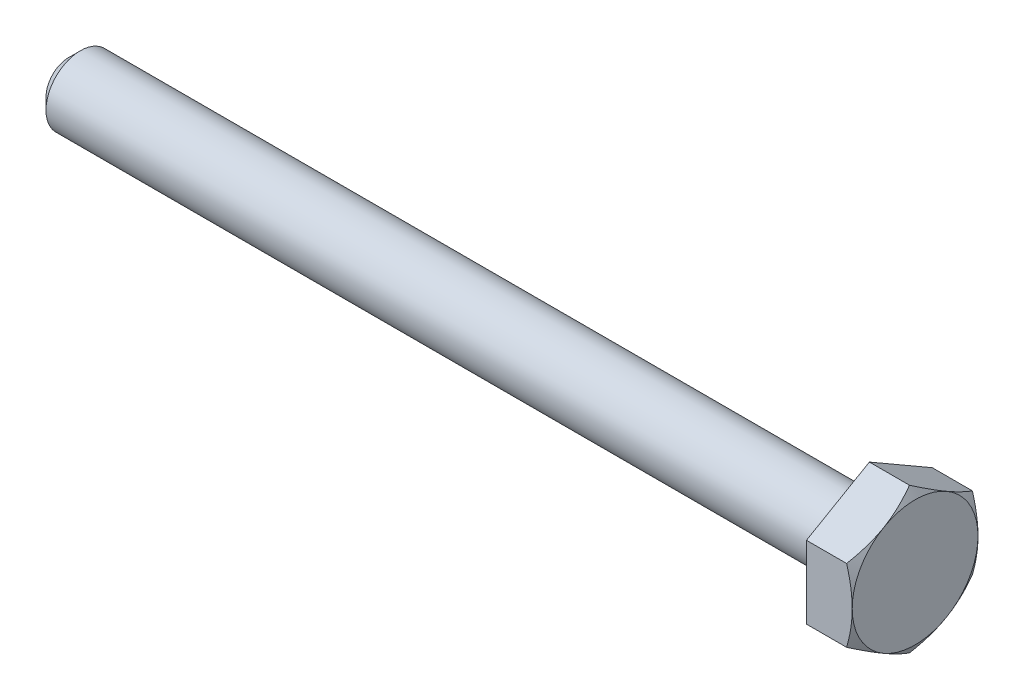
ISO-10303-21;
HEADER;
FILE_DESCRIPTION(('STEP AP214'),'2;1');
FILE_NAME('part.step','',(''),(''),'','','');
FILE_SCHEMA(('AUTOMOTIVE_DESIGN { 1 0 10303 214 1 1 1 1 }'));
ENDSEC;
DATA;
#1=APPLICATION_CONTEXT('core data for automotive mechanical design processes');
#2=APPLICATION_PROTOCOL_DEFINITION('international standard','automotive_design',2000,#1);
#3=PRODUCT_CONTEXT('',#1,'mechanical');
#4=PRODUCT('Part','Part','',(#3));
#5=PRODUCT_RELATED_PRODUCT_CATEGORY('part','',(#4));
#6=PRODUCT_DEFINITION_FORMATION('','',#4);
#7=PRODUCT_DEFINITION_CONTEXT('part definition',#1,'design');
#8=PRODUCT_DEFINITION('design','',#6,#7);
#9=PRODUCT_DEFINITION_SHAPE('','',#8);
#10=(LENGTH_UNIT() NAMED_UNIT(*) SI_UNIT(.MILLI.,.METRE.));
#11=(NAMED_UNIT(*) PLANE_ANGLE_UNIT() SI_UNIT($,.RADIAN.));
#12=(NAMED_UNIT(*) SI_UNIT($,.STERADIAN.) SOLID_ANGLE_UNIT());
#13=UNCERTAINTY_MEASURE_WITH_UNIT(LENGTH_MEASURE(1.E-05),#10,'distance_accuracy_value','');
#14=(GEOMETRIC_REPRESENTATION_CONTEXT(3) GLOBAL_UNCERTAINTY_ASSIGNED_CONTEXT((#13)) GLOBAL_UNIT_ASSIGNED_CONTEXT((#10,
#11,#12)) REPRESENTATION_CONTEXT('',''));
#15=CARTESIAN_POINT('',(0.,0.,0.));
#16=DIRECTION('',(0.,0.,1.));
#17=DIRECTION('',(1.,0.,0.));
#18=AXIS2_PLACEMENT_3D('',#15,#16,#17);
#19=CARTESIAN_POINT('',(-10.4013887740857,3.17542648054294,0.));
#20=DIRECTION('',(0.,0.866025403784439,0.5));
#21=DIRECTION('',(0.,-0.5,0.866025403784439));
#22=AXIS2_PLACEMENT_3D('',#19,#20,#21);
#23=PLANE('',#22);
#24=DIRECTION('',(1.,0.,0.));
#25=VECTOR('',#24,1.);
#26=CARTESIAN_POINT('',(-10.4013887740857,1.58771324027147,2.75));
#27=LINE('',#26,#25);
#28=CARTESIAN_POINT('',(-2.,1.58771324027147,2.75));
#29=VERTEX_POINT('',#28);
#30=CARTESIAN_POINT('',(-0.24562009306186,1.58771324027147,2.75));
#31=VERTEX_POINT('',#30);
#32=EDGE_CURVE('E251',#29,#31,#27,.T.);
#33=ORIENTED_EDGE('',*,*,#32,.T.);
#34=CARTESIAN_POINT('',(-0.245686763364758,1.58759777021763,2.7502));
#35=CARTESIAN_POINT('',(-0.205387662249261,1.65737010029698,2.62935077934009));
#36=CARTESIAN_POINT('',(-0.16873690259766,1.72774469983533,2.50745839737737));
#37=CARTESIAN_POINT('',(-0.104762182969799,1.86971254687002,2.26156287327211));
#38=CARTESIAN_POINT('',(-0.0774608556744957,1.94130831721582,2.13755536142615));
#39=CARTESIAN_POINT('',(-0.0349617452941152,2.08361254889598,1.89107720202406));
#40=CARTESIAN_POINT('',(-0.019481118622456,2.15429911309864,1.76864448141258));
#41=CARTESIAN_POINT('',(-0.00099939736993851,2.29600490065922,1.52320285763109));
#42=CARTESIAN_POINT('',(0.00201700053740233,2.36702360884403,1.40019484676709));
#43=CARTESIAN_POINT('',(-0.00425314542854439,2.49972966594896,1.17034121338921));
#44=CARTESIAN_POINT('',(-0.0120001542766999,2.56143686540072,1.06346120874598));
#45=CARTESIAN_POINT('',(-0.0365551810643523,2.68444923614046,0.850397532665251));
#46=CARTESIAN_POINT('',(-0.0533715896505678,2.74575398185007,0.744214598351111));
#47=CARTESIAN_POINT('',(-0.0954119223459535,2.86902004703206,0.530711510606817));
#48=CARTESIAN_POINT('',(-0.120814080687228,2.93096576264318,0.423418383857145));
#49=CARTESIAN_POINT('',(-0.178467225839978,3.05393320806133,0.210432520715949));
#50=CARTESIAN_POINT('',(-0.210704663298979,3.11495651365995,0.104737054973347));
#51=CARTESIAN_POINT('',(-0.245686763364757,3.17554195059677,-0.000200000000000022));
#52=B_SPLINE_CURVE_WITH_KNOTS('',3,(#34,#35,#36,#37,#38,#39,#40,#41,#42,#43,#44,#45,#46,#47,#48,
#49,#50,#51),.UNSPECIFIED.,.F.,.F.,(4,2,2,2,2,2,2,2,4),(0.,0.435912828725888,0.872873557116331,
1.29901931904671,1.72464171213573,2.09526089052937,2.46622354066374,2.84541551798557,
3.22386274754524),.UNSPECIFIED.);
#53=CARTESIAN_POINT('',(0.,2.38156986040721,1.375));
#54=VERTEX_POINT('',#53);
#55=EDGE_CURVE('E114',#31,#54,#52,.T.);
#56=ORIENTED_EDGE('',*,*,#55,.T.);
#57=CARTESIAN_POINT('',(-0.245620093061859,3.17542648054294,0.));
#58=VERTEX_POINT('',#57);
#59=EDGE_CURVE('E51',#54,#58,#52,.T.);
#60=ORIENTED_EDGE('',*,*,#59,.T.);
#61=DIRECTION('',(1.,0.,0.));
#62=VECTOR('',#61,1.);
#63=CARTESIAN_POINT('',(-10.4013887740857,3.17542648054294,0.));
#64=LINE('',#63,#62);
#65=CARTESIAN_POINT('',(-2.,3.17542648054294,0.));
#66=VERTEX_POINT('',#65);
#67=EDGE_CURVE('E232',#66,#58,#64,.T.);
#68=ORIENTED_EDGE('',*,*,#67,.F.);
#69=DIRECTION('',(0.,0.5,-0.866025403784439));
#70=VECTOR('',#69,1.);
#71=CARTESIAN_POINT('',(-2.,3.17542648054294,0.));
#72=LINE('',#71,#70);
#73=EDGE_CURVE('E242',#29,#66,#72,.T.);
#74=ORIENTED_EDGE('',*,*,#73,.F.);
#75=EDGE_LOOP('',(#33,#56,#60,#68,#74));
#76=FACE_BOUND('',#75,.T.);
#77=ADVANCED_FACE('F36',(#76),#23,.T.);
#78=CARTESIAN_POINT('',(-10.4013887740857,1.58771324027147,-2.75));
#79=DIRECTION('',(0.,0.866025403784439,-0.5));
#80=DIRECTION('',(0.,0.5,0.866025403784439));
#81=AXIS2_PLACEMENT_3D('',#78,#79,#80);
#82=PLANE('',#81);
#83=ORIENTED_EDGE('',*,*,#67,.T.);
#84=CARTESIAN_POINT('',(-0.245686763364757,3.17554195059677,0.000199999999999889));
#85=CARTESIAN_POINT('',(-0.20538766224926,3.10576962051742,-0.120649220659906));
#86=CARTESIAN_POINT('',(-0.168736902597659,3.03539502097908,-0.242541602622634));
#87=CARTESIAN_POINT('',(-0.104762182969798,2.89342717394438,-0.488437126727892));
#88=CARTESIAN_POINT('',(-0.0774608556744949,2.82183140359858,-0.612444638573854));
#89=CARTESIAN_POINT('',(-0.0349617452941147,2.67952717191842,-0.858922797975942));
#90=CARTESIAN_POINT('',(-0.0194811186224558,2.60884060771577,-0.981355518587416));
#91=CARTESIAN_POINT('',(-0.000999397369938532,2.46713482015518,-1.22679714236891));
#92=CARTESIAN_POINT('',(0.00201700053740236,2.39611611197037,-1.34980515323291));
#93=CARTESIAN_POINT('',(-0.00425314542854449,2.26341005486544,-1.57965878661079));
#94=CARTESIAN_POINT('',(-0.0120001542767001,2.20170285541368,-1.68653879125402));
#95=CARTESIAN_POINT('',(-0.0365551810643526,2.07869048467394,-1.89960246733475));
#96=CARTESIAN_POINT('',(-0.0533715896505681,2.01738573896433,-2.00578540164889));
#97=CARTESIAN_POINT('',(-0.095411922345954,1.89411967378235,-2.21928848939318));
#98=CARTESIAN_POINT('',(-0.120814080687228,1.83217395817123,-2.32658161614285));
#99=CARTESIAN_POINT('',(-0.178467225839979,1.70920651275307,-2.53956747928405));
#100=CARTESIAN_POINT('',(-0.210704663298979,1.64818320715446,-2.64526294502665));
#101=CARTESIAN_POINT('',(-0.245686763364757,1.58759777021763,-2.7502));
#102=B_SPLINE_CURVE_WITH_KNOTS('',3,(#84,#85,#86,#87,#88,#89,#90,#91,#92,#93,#94,#95,#96,#97,
#98,#99,#100,#101),.UNSPECIFIED.,.F.,.F.,(4,2,2,2,2,2,2,2,4),(0.,0.435912828725887,
0.87287355711633,1.29901931904671,1.72464171213573,2.09526089052937,2.46622354066374,
2.84541551798557,3.22386274754524),.UNSPECIFIED.);
#103=CARTESIAN_POINT('',(0.,2.38156986040721,-1.375));
#104=VERTEX_POINT('',#103);
#105=EDGE_CURVE('E185',#58,#104,#102,.T.);
#106=ORIENTED_EDGE('',*,*,#105,.T.);
#107=CARTESIAN_POINT('',(-0.245620093061859,1.58771324027147,-2.75));
#108=VERTEX_POINT('',#107);
#109=EDGE_CURVE('E59',#104,#108,#102,.T.);
#110=ORIENTED_EDGE('',*,*,#109,.T.);
#111=DIRECTION('',(1.,0.,0.));
#112=VECTOR('',#111,1.);
#113=CARTESIAN_POINT('',(-10.4013887740857,1.58771324027147,-2.75));
#114=LINE('',#113,#112);
#115=CARTESIAN_POINT('',(-2.,1.58771324027147,-2.75));
#116=VERTEX_POINT('',#115);
#117=EDGE_CURVE('E235',#116,#108,#114,.T.);
#118=ORIENTED_EDGE('',*,*,#117,.F.);
#119=DIRECTION('',(0.,-0.5,-0.866025403784439));
#120=VECTOR('',#119,1.);
#121=CARTESIAN_POINT('',(-2.,1.58771324027147,-2.75));
#122=LINE('',#121,#120);
#123=EDGE_CURVE('E233',#66,#116,#122,.T.);
#124=ORIENTED_EDGE('',*,*,#123,.F.);
#125=EDGE_LOOP('',(#83,#106,#110,#118,#124));
#126=FACE_BOUND('',#125,.T.);
#127=ADVANCED_FACE('F159',(#126),#82,.T.);
#128=CARTESIAN_POINT('',(-10.4013887740857,-1.58771324027147,-2.75));
#129=DIRECTION('',(0.,0.,-1.));
#130=DIRECTION('',(-1.,0.,0.));
#131=AXIS2_PLACEMENT_3D('',#128,#129,#130);
#132=PLANE('',#131);
#133=ORIENTED_EDGE('',*,*,#117,.T.);
#134=CARTESIAN_POINT('',(-1.59255708107006,4.77282494445559,-2.75));
#135=CARTESIAN_POINT('',(-1.53541655163729,4.65858396642317,-2.75));
#136=CARTESIAN_POINT('',(-1.47867048568092,4.54414359420139,-2.75));
#137=CARTESIAN_POINT('',(-1.36615985657659,4.31477714376181,-2.75));
#138=CARTESIAN_POINT('',(-1.31039532513564,4.19985105000168,-2.75));
#139=CARTESIAN_POINT('',(-1.19993280976673,3.96920131985217,-2.75));
#140=CARTESIAN_POINT('',(-1.14523720280532,3.85347654266311,-2.75));
#141=CARTESIAN_POINT('',(-1.03729153093637,3.62135136406463,-2.75));
#142=CARTESIAN_POINT('',(-0.984041487786225,3.50495095251809,-2.75));
#143=CARTESIAN_POINT('',(-0.87696786101102,3.26609541459747,-2.75));
#144=CARTESIAN_POINT('',(-0.823226205898884,3.14360343893143,-2.75));
#145=CARTESIAN_POINT('',(-0.718190973298418,2.89757544696494,-2.75));
#146=CARTESIAN_POINT('',(-0.666897310035495,2.77403946742389,-2.75));
#147=CARTESIAN_POINT('',(-0.567454092383856,2.52581175013779,-2.75));
#148=CARTESIAN_POINT('',(-0.519302129110342,2.40112098362696,-2.75));
#149=CARTESIAN_POINT('',(-0.426955755718839,2.15023551994533,-2.75));
#150=CARTESIAN_POINT('',(-0.382762451896562,2.02404041346349,-2.75));
#151=CARTESIAN_POINT('',(-0.289691856371039,1.74015544179621,-2.75));
#152=CARTESIAN_POINT('',(-0.242146974254297,1.58202059862527,-2.75));
#153=CARTESIAN_POINT('',(-0.157534227235877,1.26300749755252,-2.75));
#154=CARTESIAN_POINT('',(-0.12046019828901,1.10213091307466,-2.75));
#155=CARTESIAN_POINT('',(-0.0604110115298261,0.780476716937827,-2.75));
#156=CARTESIAN_POINT('',(-0.0372099993686549,0.619742624513789,-2.75));
#157=CARTESIAN_POINT('',(-0.00657806439621203,0.296787198188305,-2.75));
#158=CARTESIAN_POINT('',(0.000859562545900966,0.134566526019167,-2.75));
#159=CARTESIAN_POINT('',(-0.00102516229449548,-0.190746169681579,-2.75));
#160=CARTESIAN_POINT('',(-0.0104481791130051,-0.353837591738448,-2.75));
#161=CARTESIAN_POINT('',(-0.0449884511543012,-0.678358807465691,-2.75));
#162=CARTESIAN_POINT('',(-0.0701130468062283,-0.839787788051861,-2.75));
#163=CARTESIAN_POINT('',(-0.13381670209592,-1.16274920271509,-2.75));
#164=CARTESIAN_POINT('',(-0.172617928406297,-1.32423644205701,-2.75));
#165=CARTESIAN_POINT('',(-0.260421719139841,-1.6444473471029,-2.75));
#166=CARTESIAN_POINT('',(-0.309430017449597,-1.80316940490725,-2.75));
#167=CARTESIAN_POINT('',(-0.403764900415742,-2.084616918998,-2.75));
#168=CARTESIAN_POINT('',(-0.447663702915815,-2.20782965089682,-2.75));
#169=CARTESIAN_POINT('',(-0.539116838244357,-2.4528464667101,-2.75));
#170=CARTESIAN_POINT('',(-0.586670165192798,-2.57465092769694,-2.75));
#171=CARTESIAN_POINT('',(-0.684690627766121,-2.81717169217554,-2.75));
#172=CARTESIAN_POINT('',(-0.735159736271196,-2.93788719346298,-2.75));
#173=CARTESIAN_POINT('',(-0.838385578657603,-3.17833707831196,-2.75));
#174=CARTESIAN_POINT('',(-0.891142383449641,-3.29807143132432,-2.75));
#175=CARTESIAN_POINT('',(-0.996217807874877,-3.53167504621099,-2.75));
#176=CARTESIAN_POINT('',(-1.04846081459888,-3.64557842561137,-2.75));
#177=CARTESIAN_POINT('',(-1.15431494359639,-3.87274439019058,-2.75));
#178=CARTESIAN_POINT('',(-1.20792604464688,-3.98600698527652,-2.75));
#179=CARTESIAN_POINT('',(-1.31617682738221,-4.21179177446542,-2.75));
#180=CARTESIAN_POINT('',(-1.37081451881073,-4.324314924714,-2.75));
#181=CARTESIAN_POINT('',(-1.48102755482586,-4.5488974967187,-2.75));
#182=CARTESIAN_POINT('',(-1.53660287322809,-4.66095693131619,-2.75));
#183=CARTESIAN_POINT('',(-1.59255708107006,-4.77282494445559,-2.75));
#184=B_SPLINE_CURVE_WITH_KNOTS('',3,(#134,#135,#136,#137,#138,#139,#140,#141,#142,#143,#144,
#145,#146,#147,#148,#149,#150,#151,#152,#153,#154,#155,#156,#157,#158,#159,#160,#161,#162,#163,
#164,#165,#166,#167,#168,#169,#170,#171,#172,#173,#174,#175,#176,#177,#178,#179,#180,#181,#182,
#183),.UNSPECIFIED.,.F.,.F.,(4,2,2,2,2,2,2,2,2,2,2,2,2,2,2,2,2,2,2,2,2,2,2,2,4),(0.,
0.383204805408721,0.76642196703896,1.1504117435579,1.5344072963671,1.93567413634181,
2.33692690608693,2.73786831099897,3.13892141657086,3.63403657129583,4.12885964820764,
4.6153905959693,5.10171458170089,5.59095181842032,6.08041794297961,6.57823225640618,
7.07632697808524,7.46866040779735,7.86088623483422,8.25338063115746,8.64588720216369,
9.02181505445846,9.3977370785904,9.77299319303788,10.1482388452848),.UNSPECIFIED.);
#185=CARTESIAN_POINT('',(0.,0.,-2.75));
#186=VERTEX_POINT('',#185);
#187=EDGE_CURVE('E186',#108,#186,#184,.T.);
#188=ORIENTED_EDGE('',*,*,#187,.T.);
#189=CARTESIAN_POINT('',(-0.245620093061859,-1.58771324027147,-2.75));
#190=VERTEX_POINT('',#189);
#191=EDGE_CURVE('E175',#186,#190,#184,.T.);
#192=ORIENTED_EDGE('',*,*,#191,.T.);
#193=DIRECTION('',(1.,0.,0.));
#194=VECTOR('',#193,1.);
#195=CARTESIAN_POINT('',(-10.4013887740857,-1.58771324027147,-2.75));
#196=LINE('',#195,#194);
#197=CARTESIAN_POINT('',(-2.,-1.58771324027147,-2.75));
#198=VERTEX_POINT('',#197);
#199=EDGE_CURVE('E239',#198,#190,#196,.T.);
#200=ORIENTED_EDGE('',*,*,#199,.F.);
#201=DIRECTION('',(0.,-1.,0.));
#202=VECTOR('',#201,1.);
#203=CARTESIAN_POINT('',(-2.,-1.58771324027147,-2.75));
#204=LINE('',#203,#202);
#205=EDGE_CURVE('E392',#116,#198,#204,.T.);
#206=ORIENTED_EDGE('',*,*,#205,.F.);
#207=EDGE_LOOP('',(#133,#188,#192,#200,#206));
#208=FACE_BOUND('',#207,.T.);
#209=ADVANCED_FACE('F333',(#208),#132,.T.);
#210=CARTESIAN_POINT('',(-10.4013887740857,-3.17542648054294,0.));
#211=DIRECTION('',(0.,-0.866025403784438,-0.5));
#212=DIRECTION('',(0.,0.5,-0.866025403784438));
#213=AXIS2_PLACEMENT_3D('',#210,#211,#212);
#214=PLANE('',#213);
#215=ORIENTED_EDGE('',*,*,#199,.T.);
#216=CARTESIAN_POINT('',(-0.245686763364757,-1.58759777021763,-2.7502));
#217=CARTESIAN_POINT('',(-0.20538766224926,-1.65737010029698,-2.62935077934009));
#218=CARTESIAN_POINT('',(-0.168736902597659,-1.72774469983533,-2.50745839737736));
#219=CARTESIAN_POINT('',(-0.104762182969798,-1.86971254687002,-2.2615628732721));
#220=CARTESIAN_POINT('',(-0.0774608556744949,-1.94130831721583,-2.13755536142614));
#221=CARTESIAN_POINT('',(-0.0349617452941147,-2.08361254889598,-1.89107720202405));
#222=CARTESIAN_POINT('',(-0.019481118622456,-2.15429911309864,-1.76864448141258));
#223=CARTESIAN_POINT('',(-0.000999397369938659,-2.29600490065922,-1.52320285763108));
#224=CARTESIAN_POINT('',(0.00201700053740237,-2.36702360884403,-1.40019484676709));
#225=CARTESIAN_POINT('',(-0.00425314542854441,-2.49972966594897,-1.17034121338921));
#226=CARTESIAN_POINT('',(-0.0120001542767001,-2.56143686540072,-1.06346120874598));
#227=CARTESIAN_POINT('',(-0.0365551810643525,-2.68444923614046,-0.85039753266525));
#228=CARTESIAN_POINT('',(-0.053371589650568,-2.74575398185007,-0.744214598351111));
#229=CARTESIAN_POINT('',(-0.0954119223459539,-2.86902004703206,-0.530711510606816));
#230=CARTESIAN_POINT('',(-0.120814080687228,-2.93096576264318,-0.423418383857145));
#231=CARTESIAN_POINT('',(-0.178467225839979,-3.05393320806133,-0.210432520715948));
#232=CARTESIAN_POINT('',(-0.21070466329898,-3.11495651365995,-0.104737054973347));
#233=CARTESIAN_POINT('',(-0.245686763364758,-3.17554195059678,0.000200000000000447));
#234=B_SPLINE_CURVE_WITH_KNOTS('',3,(#216,#217,#218,#219,#220,#221,#222,#223,#224,#225,#226,
#227,#228,#229,#230,#231,#232,#233),.UNSPECIFIED.,.F.,.F.,(4,2,2,2,2,2,2,2,4),(0.,
0.435912828725887,0.87287355711633,1.29901931904671,1.72464171213573,2.09526089052937,
2.46622354066374,2.84541551798557,3.22386274754524),.UNSPECIFIED.);
#235=CARTESIAN_POINT('',(0.,-2.3815698604072,-1.375));
#236=VERTEX_POINT('',#235);
#237=EDGE_CURVE('E399',#190,#236,#234,.T.);
#238=ORIENTED_EDGE('',*,*,#237,.T.);
#239=CARTESIAN_POINT('',(-0.245620093061859,-3.17542648054294,0.));
#240=VERTEX_POINT('',#239);
#241=EDGE_CURVE('E168',#236,#240,#234,.T.);
#242=ORIENTED_EDGE('',*,*,#241,.T.);
#243=DIRECTION('',(1.,0.,0.));
#244=VECTOR('',#243,1.);
#245=CARTESIAN_POINT('',(-10.4013887740857,-3.17542648054294,0.));
#246=LINE('',#245,#244);
#247=CARTESIAN_POINT('',(-2.,-3.17542648054294,0.));
#248=VERTEX_POINT('',#247);
#249=EDGE_CURVE('E247',#248,#240,#246,.T.);
#250=ORIENTED_EDGE('',*,*,#249,.F.);
#251=DIRECTION('',(0.,-0.5,0.866025403784438));
#252=VECTOR('',#251,1.);
#253=CARTESIAN_POINT('',(-2.,-3.17542648054294,0.));
#254=LINE('',#253,#252);
#255=EDGE_CURVE('E238',#198,#248,#254,.T.);
#256=ORIENTED_EDGE('',*,*,#255,.F.);
#257=EDGE_LOOP('',(#215,#238,#242,#250,#256));
#258=FACE_BOUND('',#257,.T.);
#259=ADVANCED_FACE('F325',(#258),#214,.T.);
#260=CARTESIAN_POINT('',(-10.4013887740857,-1.58771324027147,2.75));
#261=DIRECTION('',(0.,-0.866025403784439,0.5));
#262=DIRECTION('',(0.,-0.5,-0.866025403784439));
#263=AXIS2_PLACEMENT_3D('',#260,#261,#262);
#264=PLANE('',#263);
#265=ORIENTED_EDGE('',*,*,#249,.T.);
#266=CARTESIAN_POINT('',(-0.245686763364757,-3.17554195059678,-0.000199999999999798));
#267=CARTESIAN_POINT('',(-0.20538766224926,-3.10576962051742,0.120649220659906));
#268=CARTESIAN_POINT('',(-0.16873690259766,-3.03539502097908,0.242541602622634));
#269=CARTESIAN_POINT('',(-0.104762182969799,-2.89342717394438,0.488437126727892));
#270=CARTESIAN_POINT('',(-0.0774608556744955,-2.82183140359858,0.612444638573855));
#271=CARTESIAN_POINT('',(-0.0349617452941152,-2.67952717191842,0.858922797975943));
#272=CARTESIAN_POINT('',(-0.0194811186224562,-2.60884060771577,0.981355518587416));
#273=CARTESIAN_POINT('',(-0.00099939736993909,-2.46713482015518,1.22679714236891));
#274=CARTESIAN_POINT('',(0.00201700053740153,-2.39611611197037,1.34980515323291));
#275=CARTESIAN_POINT('',(-0.00425314542854547,-2.26341005486544,1.57965878661079));
#276=CARTESIAN_POINT('',(-0.0120001542767011,-2.20170285541368,1.68653879125402));
#277=CARTESIAN_POINT('',(-0.0365551810643533,-2.07869048467394,1.89960246733475));
#278=CARTESIAN_POINT('',(-0.0533715896505688,-2.01738573896433,2.00578540164889));
#279=CARTESIAN_POINT('',(-0.0954119223459547,-1.89411967378235,2.21928848939318));
#280=CARTESIAN_POINT('',(-0.120814080687229,-1.83217395817123,2.32658161614285));
#281=CARTESIAN_POINT('',(-0.17846722583998,-1.70920651275307,2.53956747928405));
#282=CARTESIAN_POINT('',(-0.210704663298981,-1.64818320715446,2.64526294502665));
#283=CARTESIAN_POINT('',(-0.245686763364759,-1.58759777021763,2.7502));
#284=B_SPLINE_CURVE_WITH_KNOTS('',3,(#266,#267,#268,#269,#270,#271,#272,#273,#274,#275,#276,
#277,#278,#279,#280,#281,#282,#283),.UNSPECIFIED.,.F.,.F.,(4,2,2,2,2,2,2,2,4),(0.,
0.435912828725887,0.87287355711633,1.29901931904671,1.72464171213573,2.09526089052937,
2.46622354066374,2.84541551798557,3.22386274754524),.UNSPECIFIED.);
#285=CARTESIAN_POINT('',(0.,-2.38156986040721,1.375));
#286=VERTEX_POINT('',#285);
#287=EDGE_CURVE('E139',#240,#286,#284,.T.);
#288=ORIENTED_EDGE('',*,*,#287,.T.);
#289=CARTESIAN_POINT('',(-0.245620093061859,-1.58771324027146,2.75));
#290=VERTEX_POINT('',#289);
#291=EDGE_CURVE('E126',#286,#290,#284,.T.);
#292=ORIENTED_EDGE('',*,*,#291,.T.);
#293=DIRECTION('',(1.,0.,0.));
#294=VECTOR('',#293,1.);
#295=CARTESIAN_POINT('',(-10.4013887740857,-1.58771324027147,2.75));
#296=LINE('',#295,#294);
#297=CARTESIAN_POINT('',(-2.,-1.58771324027147,2.75));
#298=VERTEX_POINT('',#297);
#299=EDGE_CURVE('E138',#298,#290,#296,.T.);
#300=ORIENTED_EDGE('',*,*,#299,.F.);
#301=DIRECTION('',(0.,0.5,0.866025403784439));
#302=VECTOR('',#301,1.);
#303=CARTESIAN_POINT('',(-2.,-1.58771324027147,2.75));
#304=LINE('',#303,#302);
#305=EDGE_CURVE('E192',#248,#298,#304,.T.);
#306=ORIENTED_EDGE('',*,*,#305,.F.);
#307=EDGE_LOOP('',(#265,#288,#292,#300,#306));
#308=FACE_BOUND('',#307,.T.);
#309=ADVANCED_FACE('F318',(#308),#264,.T.);
#310=CARTESIAN_POINT('',(-10.4013887740857,1.58771324027147,2.75));
#311=DIRECTION('',(0.,0.,1.));
#312=DIRECTION('',(0.,-1.,0.));
#313=AXIS2_PLACEMENT_3D('',#310,#311,#312);
#314=PLANE('',#313);
#315=ORIENTED_EDGE('',*,*,#299,.T.);
#316=CARTESIAN_POINT('',(-1.59255708107006,-4.77282494445559,2.75));
#317=CARTESIAN_POINT('',(-1.53541655163729,-4.65858396642317,2.75));
#318=CARTESIAN_POINT('',(-1.47867048568092,-4.54414359420139,2.75));
#319=CARTESIAN_POINT('',(-1.36615985657659,-4.31477714376181,2.75));
#320=CARTESIAN_POINT('',(-1.31039532513564,-4.19985105000168,2.75));
#321=CARTESIAN_POINT('',(-1.19993280976673,-3.96920131985217,2.75));
#322=CARTESIAN_POINT('',(-1.14523720280532,-3.85347654266311,2.75));
#323=CARTESIAN_POINT('',(-1.03729153093637,-3.62135136406463,2.75));
#324=CARTESIAN_POINT('',(-0.984041487786225,-3.50495095251809,2.75));
#325=CARTESIAN_POINT('',(-0.87696786101102,-3.26609541459746,2.75));
#326=CARTESIAN_POINT('',(-0.823226205898885,-3.14360343893143,2.75));
#327=CARTESIAN_POINT('',(-0.718190973298419,-2.89757544696494,2.75));
#328=CARTESIAN_POINT('',(-0.666897310035496,-2.77403946742388,2.75));
#329=CARTESIAN_POINT('',(-0.567454092383856,-2.52581175013779,2.75));
#330=CARTESIAN_POINT('',(-0.519302129110343,-2.40112098362695,2.75));
#331=CARTESIAN_POINT('',(-0.42695575571884,-2.15023551994533,2.75));
#332=CARTESIAN_POINT('',(-0.382762451896562,-2.02404041346349,2.75));
#333=CARTESIAN_POINT('',(-0.28969185637104,-1.74015544179621,2.75));
#334=CARTESIAN_POINT('',(-0.242146974254298,-1.58202059862527,2.75));
#335=CARTESIAN_POINT('',(-0.157534227235878,-1.26300749755252,2.75));
#336=CARTESIAN_POINT('',(-0.120460198289012,-1.10213091307466,2.75));
#337=CARTESIAN_POINT('',(-0.0604110115298274,-0.780476716937825,2.75));
#338=CARTESIAN_POINT('',(-0.0372099993686562,-0.619742624513787,2.75));
#339=CARTESIAN_POINT('',(-0.00657806439621357,-0.296787198188302,2.75));
#340=CARTESIAN_POINT('',(0.000859562545899322,-0.134566526019164,2.75));
#341=CARTESIAN_POINT('',(-0.00102516229449731,0.190746169681582,2.75));
#342=CARTESIAN_POINT('',(-0.010448179113007,0.353837591738451,2.75));
#343=CARTESIAN_POINT('',(-0.0449884511543035,0.678358807465694,2.75));
#344=CARTESIAN_POINT('',(-0.0701130468062308,0.839787788051865,2.75));
#345=CARTESIAN_POINT('',(-0.133816702095922,1.16274920271509,2.75));
#346=CARTESIAN_POINT('',(-0.1726179284063,1.32423644205702,2.75));
#347=CARTESIAN_POINT('',(-0.260421719139844,1.64444734710291,2.75));
#348=CARTESIAN_POINT('',(-0.3094300174496,1.80316940490725,2.75));
#349=CARTESIAN_POINT('',(-0.403764900415745,2.084616918998,2.75));
#350=CARTESIAN_POINT('',(-0.447663702915818,2.20782965089682,2.75));
#351=CARTESIAN_POINT('',(-0.53911683824436,2.4528464667101,2.75));
#352=CARTESIAN_POINT('',(-0.586670165192801,2.57465092769695,2.75));
#353=CARTESIAN_POINT('',(-0.684690627766123,2.81717169217555,2.75));
#354=CARTESIAN_POINT('',(-0.735159736271198,2.93788719346298,2.75));
#355=CARTESIAN_POINT('',(-0.838385578657605,3.17833707831196,2.75));
#356=CARTESIAN_POINT('',(-0.891142383449643,3.29807143132432,2.75));
#357=CARTESIAN_POINT('',(-0.996217807874878,3.53167504621099,2.75));
#358=CARTESIAN_POINT('',(-1.04846081459888,3.64557842561137,2.75));
#359=CARTESIAN_POINT('',(-1.15431494359639,3.87274439019058,2.75));
#360=CARTESIAN_POINT('',(-1.20792604464688,3.98600698527652,2.75));
#361=CARTESIAN_POINT('',(-1.31617682738222,4.21179177446541,2.75));
#362=CARTESIAN_POINT('',(-1.37081451881073,4.324314924714,2.75));
#363=CARTESIAN_POINT('',(-1.48102755482586,4.5488974967187,2.75));
#364=CARTESIAN_POINT('',(-1.53660287322809,4.66095693131618,2.75));
#365=CARTESIAN_POINT('',(-1.59255708107006,4.77282494445559,2.75));
#366=B_SPLINE_CURVE_WITH_KNOTS('',3,(#316,#317,#318,#319,#320,#321,#322,#323,#324,#325,#326,
#327,#328,#329,#330,#331,#332,#333,#334,#335,#336,#337,#338,#339,#340,#341,#342,#343,#344,#345,
#346,#347,#348,#349,#350,#351,#352,#353,#354,#355,#356,#357,#358,#359,#360,#361,#362,#363,#364,
#365),.UNSPECIFIED.,.F.,.F.,(4,2,2,2,2,2,2,2,2,2,2,2,2,2,2,2,2,2,2,2,2,2,2,2,4),(0.,
0.38320480540872,0.766421967038959,1.1504117435579,1.5344072963671,1.93567413634181,
2.33692690608693,2.73786831099897,3.13892141657086,3.63403657129583,4.12885964820764,
4.6153905959693,5.10171458170089,5.59095181842032,6.08041794297961,6.57823225640618,
7.07632697808524,7.46866040779735,7.86088623483422,8.25338063115746,8.64588720216369,
9.02181505445846,9.3977370785904,9.77299319303788,10.1482388452847),.UNSPECIFIED.);
#367=CARTESIAN_POINT('',(0.,0.,2.75));
#368=VERTEX_POINT('',#367);
#369=EDGE_CURVE('E119',#290,#368,#366,.T.);
#370=ORIENTED_EDGE('',*,*,#369,.T.);
#371=EDGE_CURVE('E107',#368,#31,#366,.T.);
#372=ORIENTED_EDGE('',*,*,#371,.T.);
#373=ORIENTED_EDGE('',*,*,#32,.F.);
#374=DIRECTION('',(0.,1.,0.));
#375=VECTOR('',#374,1.);
#376=CARTESIAN_POINT('',(-2.,1.58771324027147,2.75));
#377=LINE('',#376,#375);
#378=EDGE_CURVE('E253',#298,#29,#377,.T.);
#379=ORIENTED_EDGE('',*,*,#378,.F.);
#380=EDGE_LOOP('',(#315,#370,#372,#373,#379));
#381=FACE_BOUND('',#380,.T.);
#382=ADVANCED_FACE('F136',(#381),#314,.T.);
#383=CARTESIAN_POINT('',(-2.,2.75,0.));
#384=DIRECTION('',(1.,0.,0.));
#385=DIRECTION('',(0.,0.,-1.));
#386=AXIS2_PLACEMENT_3D('',#383,#384,#385);
#387=PLANE('',#386);
#388=CARTESIAN_POINT('',(-1.99999999999999,0.,0.));
#389=DIRECTION('',(-1.,0.,0.));
#390=DIRECTION('',(0.,0.,1.));
#391=AXIS2_PLACEMENT_3D('',#388,#389,#390);
#392=CIRCLE('',#391,1.5);
#393=CARTESIAN_POINT('',(-1.99999999999999,0.,1.5));
#394=VERTEX_POINT('',#393);
#395=EDGE_CURVE('E256',#394,#394,#392,.T.);
#396=ORIENTED_EDGE('',*,*,#395,.F.);
#397=EDGE_LOOP('',(#396));
#398=FACE_BOUND('',#397,.T.);
#399=ORIENTED_EDGE('',*,*,#305,.T.);
#400=ORIENTED_EDGE('',*,*,#378,.T.);
#401=ORIENTED_EDGE('',*,*,#73,.T.);
#402=ORIENTED_EDGE('',*,*,#123,.T.);
#403=ORIENTED_EDGE('',*,*,#205,.T.);
#404=ORIENTED_EDGE('',*,*,#255,.T.);
#405=EDGE_LOOP('',(#399,#400,#401,#402,#403,#404));
#406=FACE_BOUND('',#405,.T.);
#407=ADVANCED_FACE('F205',(#398,#406),#387,.F.);
#408=CARTESIAN_POINT('',(-37.,0.,0.));
#409=DIRECTION('',(-1.,0.,0.));
#410=DIRECTION('',(0.,0.,1.));
#411=AXIS2_PLACEMENT_3D('',#408,#409,#410);
#412=CYLINDRICAL_SURFACE('',#411,1.5);
#413=CARTESIAN_POINT('',(-36.5,0.,0.));
#414=DIRECTION('',(1.,0.,0.));
#415=DIRECTION('',(0.,0.,-1.));
#416=AXIS2_PLACEMENT_3D('',#413,#414,#415);
#417=CIRCLE('',#416,1.5);
#418=CARTESIAN_POINT('',(-36.5,0.,-1.5));
#419=VERTEX_POINT('',#418);
#420=EDGE_CURVE('E131',#419,#419,#417,.T.);
#421=ORIENTED_EDGE('',*,*,#420,.T.);
#422=EDGE_LOOP('',(#421));
#423=FACE_BOUND('',#422,.T.);
#424=ORIENTED_EDGE('',*,*,#395,.T.);
#425=EDGE_LOOP('',(#424));
#426=FACE_BOUND('',#425,.T.);
#427=ADVANCED_FACE('F201',(#423,#426),#412,.T.);
#428=CARTESIAN_POINT('',(-37.,1.5,0.));
#429=DIRECTION('',(1.,0.,0.));
#430=DIRECTION('',(0.,0.,-1.));
#431=AXIS2_PLACEMENT_3D('',#428,#429,#430);
#432=PLANE('',#431);
#433=CARTESIAN_POINT('',(-37.,0.,0.));
#434=DIRECTION('',(1.,0.,0.));
#435=DIRECTION('',(0.,0.,-1.));
#436=AXIS2_PLACEMENT_3D('',#433,#434,#435);
#437=CIRCLE('',#436,0.999999999999987);
#438=CARTESIAN_POINT('',(-37.,0.,-0.999999999999987));
#439=VERTEX_POINT('',#438);
#440=EDGE_CURVE('E259',#439,#439,#437,.F.);
#441=ORIENTED_EDGE('',*,*,#440,.T.);
#442=EDGE_LOOP('',(#441));
#443=FACE_BOUND('',#442,.T.);
#444=ADVANCED_FACE('F198',(#443),#432,.F.);
#445=CARTESIAN_POINT('',(-37.,0.,0.));
#446=DIRECTION('',(1.,0.,0.));
#447=DIRECTION('',(0.,0.,-1.));
#448=AXIS2_PLACEMENT_3D('',#445,#446,#447);
#449=CONICAL_SURFACE('',#448,0.999999999999987,0.785398163397452);
#450=ORIENTED_EDGE('',*,*,#420,.F.);
#451=EDGE_LOOP('',(#450));
#452=FACE_BOUND('',#451,.T.);
#453=ORIENTED_EDGE('',*,*,#440,.F.);
#454=EDGE_LOOP('',(#453));
#455=FACE_BOUND('',#454,.T.);
#456=ADVANCED_FACE('F38',(#452,#455),#449,.T.);
#457=CARTESIAN_POINT('',(-0.245620093061859,0.,0.));
#458=DIRECTION('',(-1.,0.,0.));
#459=DIRECTION('',(0.,0.,1.));
#460=AXIS2_PLACEMENT_3D('',#457,#458,#459);
#461=CONICAL_SURFACE('',#460,3.17542648054294,1.0471975511966);
#462=CARTESIAN_POINT('',(0.,0.,0.));
#463=DIRECTION('',(-1.,0.,0.));
#464=DIRECTION('',(0.,0.,1.));
#465=AXIS2_PLACEMENT_3D('',#462,#463,#464);
#466=CIRCLE('',#465,2.75);
#467=EDGE_CURVE('E40',#286,#368,#466,.T.);
#468=ORIENTED_EDGE('',*,*,#467,.T.);
#469=ORIENTED_EDGE('',*,*,#369,.F.);
#470=ORIENTED_EDGE('',*,*,#291,.F.);
#471=EDGE_LOOP('',(#468,#469,#470));
#472=FACE_BOUND('',#471,.T.);
#473=ADVANCED_FACE('F124',(#472),#461,.T.);
#474=EDGE_CURVE('E130',#236,#286,#466,.T.);
#475=ORIENTED_EDGE('',*,*,#474,.T.);
#476=ORIENTED_EDGE('',*,*,#287,.F.);
#477=ORIENTED_EDGE('',*,*,#241,.F.);
#478=EDGE_LOOP('',(#475,#476,#477));
#479=FACE_BOUND('',#478,.T.);
#480=ADVANCED_FACE('F158',(#479),#461,.T.);
#481=EDGE_CURVE('E225',#186,#236,#466,.T.);
#482=ORIENTED_EDGE('',*,*,#481,.T.);
#483=ORIENTED_EDGE('',*,*,#237,.F.);
#484=ORIENTED_EDGE('',*,*,#191,.F.);
#485=EDGE_LOOP('',(#482,#483,#484));
#486=FACE_BOUND('',#485,.T.);
#487=ADVANCED_FACE('F221',(#486),#461,.T.);
#488=EDGE_CURVE('E45',#104,#186,#466,.T.);
#489=ORIENTED_EDGE('',*,*,#488,.T.);
#490=ORIENTED_EDGE('',*,*,#187,.F.);
#491=ORIENTED_EDGE('',*,*,#109,.F.);
#492=EDGE_LOOP('',(#489,#490,#491));
#493=FACE_BOUND('',#492,.T.);
#494=ADVANCED_FACE('F217',(#493),#461,.T.);
#495=EDGE_CURVE('E11',#54,#104,#466,.T.);
#496=ORIENTED_EDGE('',*,*,#495,.T.);
#497=ORIENTED_EDGE('',*,*,#105,.F.);
#498=ORIENTED_EDGE('',*,*,#59,.F.);
#499=EDGE_LOOP('',(#496,#497,#498));
#500=FACE_BOUND('',#499,.T.);
#501=ADVANCED_FACE('F213',(#500),#461,.T.);
#502=ORIENTED_EDGE('',*,*,#371,.F.);
#503=CARTESIAN_POINT('',(0.,0.,0.));
#504=DIRECTION('',(-1.,0.,0.));
#505=DIRECTION('',(0.,0.,1.));
#506=AXIS2_PLACEMENT_3D('',#503,#504,#505);
#507=CIRCLE('',#506,2.75);
#508=EDGE_CURVE('E111',#368,#54,#507,.T.);
#509=ORIENTED_EDGE('',*,*,#508,.T.);
#510=ORIENTED_EDGE('',*,*,#55,.F.);
#511=EDGE_LOOP('',(#502,#509,#510));
#512=FACE_BOUND('',#511,.T.);
#513=ADVANCED_FACE('F109',(#512),#461,.T.);
#514=CARTESIAN_POINT('',(0.,0.,0.));
#515=DIRECTION('',(-1.,0.,0.));
#516=DIRECTION('',(0.,0.,1.));
#517=AXIS2_PLACEMENT_3D('',#514,#515,#516);
#518=PLANE('',#517);
#519=ORIENTED_EDGE('',*,*,#508,.F.);
#520=ORIENTED_EDGE('',*,*,#467,.F.);
#521=ORIENTED_EDGE('',*,*,#474,.F.);
#522=ORIENTED_EDGE('',*,*,#481,.F.);
#523=ORIENTED_EDGE('',*,*,#488,.F.);
#524=ORIENTED_EDGE('',*,*,#495,.F.);
#525=EDGE_LOOP('',(#519,#520,#521,#522,#523,#524));
#526=FACE_BOUND('',#525,.T.);
#527=ADVANCED_FACE('F132',(#526),#518,.F.);
#528=CLOSED_SHELL('',(#77,#127,#209,#259,#309,#382,#407,#427,#444,#456,#473,#480,#487,#494,#501,
#513,#527));
#529=MANIFOLD_SOLID_BREP('B2',#528);
#530=ADVANCED_BREP_SHAPE_REPRESENTATION('',(#18,#529),#14);
#531=SHAPE_DEFINITION_REPRESENTATION(#9,#530);
ENDSEC;
END-ISO-10303-21;
